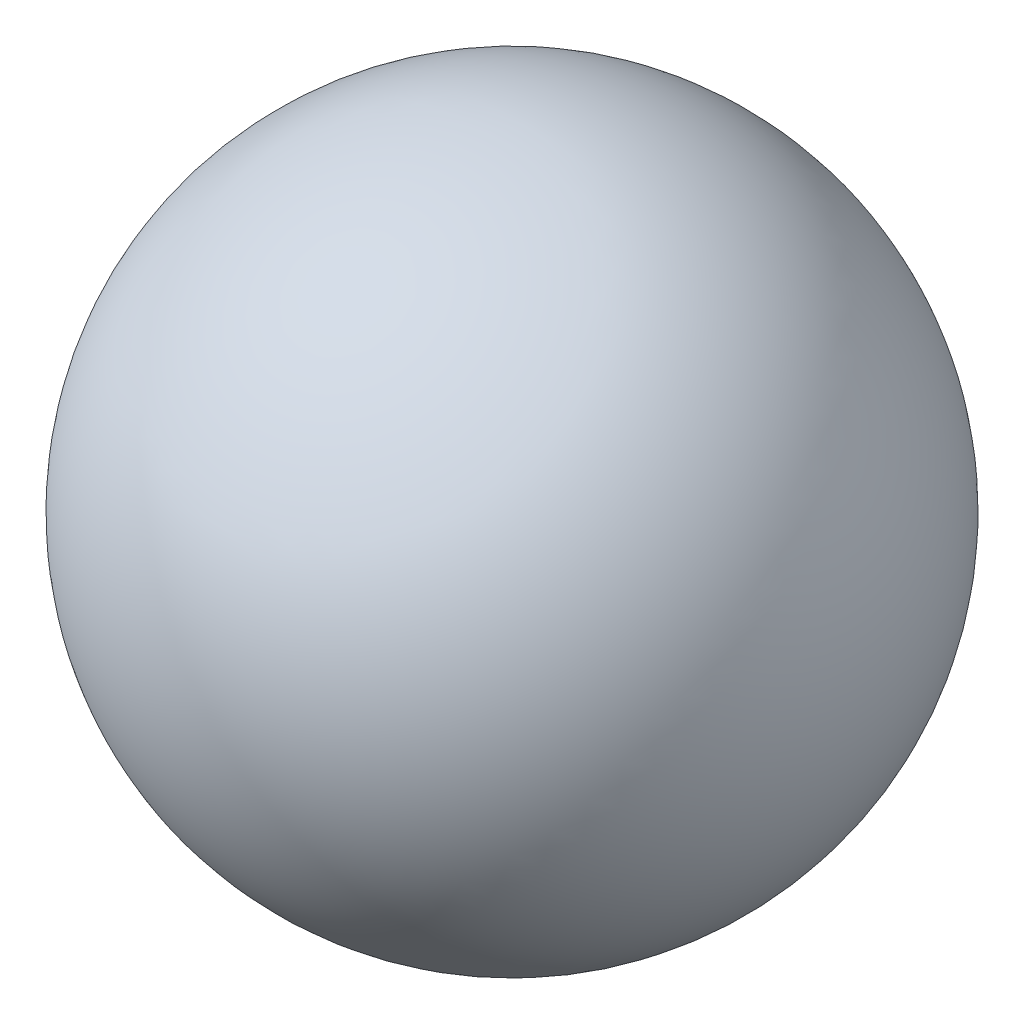
ISO-10303-21;
HEADER;
FILE_DESCRIPTION(('STEP AP214'),'2;1');
FILE_NAME('part.step','',(''),(''),'','','');
FILE_SCHEMA(('AUTOMOTIVE_DESIGN { 1 0 10303 214 1 1 1 1 }'));
ENDSEC;
DATA;
#1=APPLICATION_CONTEXT('core data for automotive mechanical design processes');
#2=APPLICATION_PROTOCOL_DEFINITION('international standard','automotive_design',2000,#1);
#3=PRODUCT_CONTEXT('',#1,'mechanical');
#4=PRODUCT('Part','Part','',(#3));
#5=PRODUCT_RELATED_PRODUCT_CATEGORY('part','',(#4));
#6=PRODUCT_DEFINITION_FORMATION('','',#4);
#7=PRODUCT_DEFINITION_CONTEXT('part definition',#1,'design');
#8=PRODUCT_DEFINITION('design','',#6,#7);
#9=PRODUCT_DEFINITION_SHAPE('','',#8);
#10=(LENGTH_UNIT() NAMED_UNIT(*) SI_UNIT(.MILLI.,.METRE.));
#11=(NAMED_UNIT(*) PLANE_ANGLE_UNIT() SI_UNIT($,.RADIAN.));
#12=(NAMED_UNIT(*) SI_UNIT($,.STERADIAN.) SOLID_ANGLE_UNIT());
#13=UNCERTAINTY_MEASURE_WITH_UNIT(LENGTH_MEASURE(1.E-05),#10,'distance_accuracy_value','');
#14=(GEOMETRIC_REPRESENTATION_CONTEXT(3) GLOBAL_UNCERTAINTY_ASSIGNED_CONTEXT((#13)) GLOBAL_UNIT_ASSIGNED_CONTEXT((#10,
#11,#12)) REPRESENTATION_CONTEXT('',''));
#15=CARTESIAN_POINT('',(0.,0.,0.));
#16=DIRECTION('',(0.,0.,1.));
#17=DIRECTION('',(1.,0.,0.));
#18=AXIS2_PLACEMENT_3D('',#15,#16,#17);
#19=CARTESIAN_POINT('',(-5.38416163029707,-2.,-10.4438165216954));
#20=DIRECTION('',(0.,0.,1.));
#21=DIRECTION('',(1.,0.,0.));
#22=AXIS2_PLACEMENT_3D('',#19,#20,#21);
#23=SPHERICAL_SURFACE('',#22,1.05);
#24=CARTESIAN_POINT('',(-5.38416163029707,-2.,-9.3938165216954));
#25=VERTEX_POINT('',#24);
#26=VERTEX_LOOP('',#25);
#27=FACE_BOUND('',#26,.T.);
#28=ADVANCED_FACE('F12',(#27),#23,.T.);
#29=CLOSED_SHELL('',(#28));
#30=MANIFOLD_SOLID_BREP('B1',#29);
#31=ADVANCED_BREP_SHAPE_REPRESENTATION('',(#18,#30),#14);
#32=SHAPE_DEFINITION_REPRESENTATION(#9,#31);
ENDSEC;
END-ISO-10303-21;
